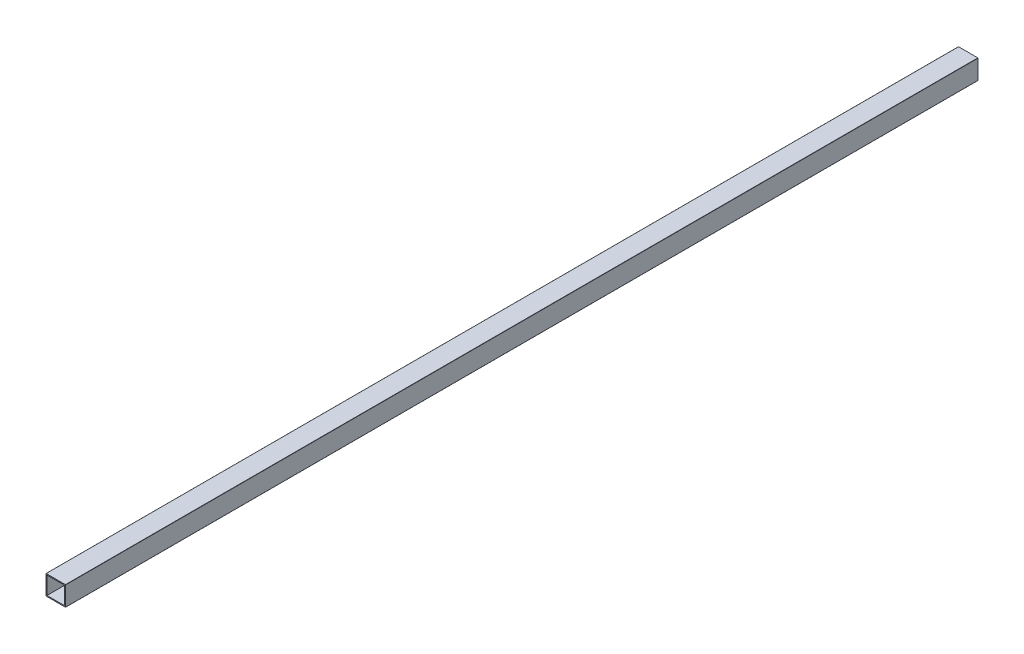
ISO-10303-21;
HEADER;
FILE_DESCRIPTION(('STEP AP214'),'2;1');
FILE_NAME('part.step','',(''),(''),'','','');
FILE_SCHEMA(('AUTOMOTIVE_DESIGN { 1 0 10303 214 1 1 1 1 }'));
ENDSEC;
DATA;
#1=APPLICATION_CONTEXT('core data for automotive mechanical design processes');
#2=APPLICATION_PROTOCOL_DEFINITION('international standard','automotive_design',2000,#1);
#3=PRODUCT_CONTEXT('',#1,'mechanical');
#4=PRODUCT('Part','Part','',(#3));
#5=PRODUCT_RELATED_PRODUCT_CATEGORY('part','',(#4));
#6=PRODUCT_DEFINITION_FORMATION('','',#4);
#7=PRODUCT_DEFINITION_CONTEXT('part definition',#1,'design');
#8=PRODUCT_DEFINITION('design','',#6,#7);
#9=PRODUCT_DEFINITION_SHAPE('','',#8);
#10=(LENGTH_UNIT() NAMED_UNIT(*) SI_UNIT(.MILLI.,.METRE.));
#11=(NAMED_UNIT(*) PLANE_ANGLE_UNIT() SI_UNIT($,.RADIAN.));
#12=(NAMED_UNIT(*) SI_UNIT($,.STERADIAN.) SOLID_ANGLE_UNIT());
#13=UNCERTAINTY_MEASURE_WITH_UNIT(LENGTH_MEASURE(1.E-05),#10,'distance_accuracy_value','');
#14=(GEOMETRIC_REPRESENTATION_CONTEXT(3) GLOBAL_UNCERTAINTY_ASSIGNED_CONTEXT((#13)) GLOBAL_UNIT_ASSIGNED_CONTEXT((#10,
#11,#12)) REPRESENTATION_CONTEXT('',''));
#15=CARTESIAN_POINT('',(0.,0.,0.));
#16=DIRECTION('',(0.,0.,1.));
#17=DIRECTION('',(1.,0.,0.));
#18=AXIS2_PLACEMENT_3D('',#15,#16,#17);
#19=CARTESIAN_POINT('',(0.2,0.2,930.));
#20=DIRECTION('',(0.,0.,-1.));
#21=DIRECTION('',(-1.,0.,0.));
#22=AXIS2_PLACEMENT_3D('',#19,#20,#21);
#23=PLANE('',#22);
#24=CARTESIAN_POINT('',(0.2,0.2,930.));
#25=DIRECTION('',(0.,0.,1.));
#26=DIRECTION('',(-1.,0.,0.));
#27=AXIS2_PLACEMENT_3D('',#24,#25,#26);
#28=CIRCLE('',#27,0.2);
#29=CARTESIAN_POINT('',(0.,0.200000000000001,930.));
#30=VERTEX_POINT('',#29);
#31=CARTESIAN_POINT('',(0.200000000000001,0.,930.));
#32=VERTEX_POINT('',#31);
#33=EDGE_CURVE('E159',#30,#32,#28,.T.);
#34=ORIENTED_EDGE('',*,*,#33,.T.);
#35=DIRECTION('',(1.,0.,0.));
#36=VECTOR('',#35,1.);
#37=CARTESIAN_POINT('',(0.200000000000001,0.,930.));
#38=LINE('',#37,#36);
#39=CARTESIAN_POINT('',(19.8,0.,930.));
#40=VERTEX_POINT('',#39);
#41=EDGE_CURVE('E162',#32,#40,#38,.T.);
#42=ORIENTED_EDGE('',*,*,#41,.T.);
#43=CARTESIAN_POINT('',(19.8,0.2,930.));
#44=DIRECTION('',(0.,0.,1.));
#45=DIRECTION('',(1.,0.,0.));
#46=AXIS2_PLACEMENT_3D('',#43,#44,#45);
#47=CIRCLE('',#46,0.199999999999999);
#48=CARTESIAN_POINT('',(20.,0.2,930.));
#49=VERTEX_POINT('',#48);
#50=EDGE_CURVE('E165',#40,#49,#47,.T.);
#51=ORIENTED_EDGE('',*,*,#50,.T.);
#52=DIRECTION('',(0.,1.,0.));
#53=VECTOR('',#52,1.);
#54=CARTESIAN_POINT('',(20.,0.2,930.));
#55=LINE('',#54,#53);
#56=CARTESIAN_POINT('',(20.,19.8,930.));
#57=VERTEX_POINT('',#56);
#58=EDGE_CURVE('E167',#49,#57,#55,.T.);
#59=ORIENTED_EDGE('',*,*,#58,.T.);
#60=CARTESIAN_POINT('',(19.8,19.8,930.));
#61=DIRECTION('',(0.,0.,1.));
#62=DIRECTION('',(-1.,0.,0.));
#63=AXIS2_PLACEMENT_3D('',#60,#61,#62);
#64=CIRCLE('',#63,0.199999999999997);
#65=CARTESIAN_POINT('',(19.8,20.,930.));
#66=VERTEX_POINT('',#65);
#67=EDGE_CURVE('E169',#57,#66,#64,.T.);
#68=ORIENTED_EDGE('',*,*,#67,.T.);
#69=DIRECTION('',(-1.,0.,0.));
#70=VECTOR('',#69,1.);
#71=CARTESIAN_POINT('',(0.2,20.,930.));
#72=LINE('',#71,#70);
#73=CARTESIAN_POINT('',(0.2,20.,930.));
#74=VERTEX_POINT('',#73);
#75=EDGE_CURVE('E171',#66,#74,#72,.T.);
#76=ORIENTED_EDGE('',*,*,#75,.T.);
#77=CARTESIAN_POINT('',(0.2,19.8,930.));
#78=DIRECTION('',(0.,0.,1.));
#79=DIRECTION('',(-1.,0.,0.));
#80=AXIS2_PLACEMENT_3D('',#77,#78,#79);
#81=CIRCLE('',#80,0.199999999999998);
#82=CARTESIAN_POINT('',(0.,19.8,930.));
#83=VERTEX_POINT('',#82);
#84=EDGE_CURVE('E173',#74,#83,#81,.T.);
#85=ORIENTED_EDGE('',*,*,#84,.T.);
#86=DIRECTION('',(0.,-1.,0.));
#87=VECTOR('',#86,1.);
#88=CARTESIAN_POINT('',(0.,0.200000000000001,930.));
#89=LINE('',#88,#87);
#90=EDGE_CURVE('E175',#83,#30,#89,.T.);
#91=ORIENTED_EDGE('',*,*,#90,.T.);
#92=EDGE_LOOP('',(#34,#42,#51,#59,#68,#76,#85,#91));
#93=FACE_BOUND('',#92,.T.);
#94=DIRECTION('',(0.,-1.,0.));
#95=VECTOR('',#94,1.);
#96=CARTESIAN_POINT('',(1.,1.,930.));
#97=LINE('',#96,#95);
#98=CARTESIAN_POINT('',(1.,19.,930.));
#99=VERTEX_POINT('',#98);
#100=CARTESIAN_POINT('',(1.,1.,930.));
#101=VERTEX_POINT('',#100);
#102=EDGE_CURVE('E123',#99,#101,#97,.T.);
#103=ORIENTED_EDGE('',*,*,#102,.F.);
#104=DIRECTION('',(-1.,0.,0.));
#105=VECTOR('',#104,1.);
#106=CARTESIAN_POINT('',(1.,19.,930.));
#107=LINE('',#106,#105);
#108=CARTESIAN_POINT('',(19.,19.,930.));
#109=VERTEX_POINT('',#108);
#110=EDGE_CURVE('E145',#109,#99,#107,.T.);
#111=ORIENTED_EDGE('',*,*,#110,.F.);
#112=DIRECTION('',(0.,1.,0.));
#113=VECTOR('',#112,1.);
#114=CARTESIAN_POINT('',(19.,1.,930.));
#115=LINE('',#114,#113);
#116=CARTESIAN_POINT('',(19.,1.,930.));
#117=VERTEX_POINT('',#116);
#118=EDGE_CURVE('E143',#117,#109,#115,.T.);
#119=ORIENTED_EDGE('',*,*,#118,.F.);
#120=DIRECTION('',(1.,0.,0.));
#121=VECTOR('',#120,1.);
#122=CARTESIAN_POINT('',(1.,1.,930.));
#123=LINE('',#122,#121);
#124=EDGE_CURVE('E131',#101,#117,#123,.T.);
#125=ORIENTED_EDGE('',*,*,#124,.F.);
#126=EDGE_LOOP('',(#103,#111,#119,#125));
#127=FACE_BOUND('',#126,.T.);
#128=ADVANCED_FACE('F34',(#93,#127),#23,.F.);
#129=CARTESIAN_POINT('',(0.2,0.2,0.));
#130=DIRECTION('',(0.,0.,-1.));
#131=DIRECTION('',(-1.,0.,0.));
#132=AXIS2_PLACEMENT_3D('',#129,#130,#131);
#133=PLANE('',#132);
#134=CARTESIAN_POINT('',(0.2,0.2,0.));
#135=DIRECTION('',(0.,0.,1.));
#136=DIRECTION('',(-1.,0.,0.));
#137=AXIS2_PLACEMENT_3D('',#134,#135,#136);
#138=CIRCLE('',#137,0.2);
#139=CARTESIAN_POINT('',(0.,0.200000000000001,0.));
#140=VERTEX_POINT('',#139);
#141=CARTESIAN_POINT('',(0.200000000000001,0.,0.));
#142=VERTEX_POINT('',#141);
#143=EDGE_CURVE('E139',#140,#142,#138,.T.);
#144=ORIENTED_EDGE('',*,*,#143,.F.);
#145=DIRECTION('',(0.,-1.,0.));
#146=VECTOR('',#145,1.);
#147=CARTESIAN_POINT('',(0.,0.200000000000001,0.));
#148=LINE('',#147,#146);
#149=CARTESIAN_POINT('',(0.,19.8,0.));
#150=VERTEX_POINT('',#149);
#151=EDGE_CURVE('E163',#150,#140,#148,.T.);
#152=ORIENTED_EDGE('',*,*,#151,.F.);
#153=CARTESIAN_POINT('',(0.2,19.8,0.));
#154=DIRECTION('',(0.,0.,1.));
#155=DIRECTION('',(-1.,0.,0.));
#156=AXIS2_PLACEMENT_3D('',#153,#154,#155);
#157=CIRCLE('',#156,0.199999999999998);
#158=CARTESIAN_POINT('',(0.2,20.,0.));
#159=VERTEX_POINT('',#158);
#160=EDGE_CURVE('E190',#159,#150,#157,.T.);
#161=ORIENTED_EDGE('',*,*,#160,.F.);
#162=DIRECTION('',(-1.,0.,0.));
#163=VECTOR('',#162,1.);
#164=CARTESIAN_POINT('',(0.2,20.,0.));
#165=LINE('',#164,#163);
#166=CARTESIAN_POINT('',(19.8,20.,0.));
#167=VERTEX_POINT('',#166);
#168=EDGE_CURVE('E188',#167,#159,#165,.T.);
#169=ORIENTED_EDGE('',*,*,#168,.F.);
#170=CARTESIAN_POINT('',(19.8,19.8,0.));
#171=DIRECTION('',(0.,0.,1.));
#172=DIRECTION('',(-1.,0.,0.));
#173=AXIS2_PLACEMENT_3D('',#170,#171,#172);
#174=CIRCLE('',#173,0.199999999999997);
#175=CARTESIAN_POINT('',(20.,19.8,0.));
#176=VERTEX_POINT('',#175);
#177=EDGE_CURVE('E186',#176,#167,#174,.T.);
#178=ORIENTED_EDGE('',*,*,#177,.F.);
#179=DIRECTION('',(0.,1.,0.));
#180=VECTOR('',#179,1.);
#181=CARTESIAN_POINT('',(20.,0.2,0.));
#182=LINE('',#181,#180);
#183=CARTESIAN_POINT('',(20.,0.2,0.));
#184=VERTEX_POINT('',#183);
#185=EDGE_CURVE('E184',#184,#176,#182,.T.);
#186=ORIENTED_EDGE('',*,*,#185,.F.);
#187=CARTESIAN_POINT('',(19.8,0.2,0.));
#188=DIRECTION('',(0.,0.,1.));
#189=DIRECTION('',(1.,0.,0.));
#190=AXIS2_PLACEMENT_3D('',#187,#188,#189);
#191=CIRCLE('',#190,0.199999999999999);
#192=CARTESIAN_POINT('',(19.8,0.,0.));
#193=VERTEX_POINT('',#192);
#194=EDGE_CURVE('E182',#193,#184,#191,.T.);
#195=ORIENTED_EDGE('',*,*,#194,.F.);
#196=DIRECTION('',(1.,0.,0.));
#197=VECTOR('',#196,1.);
#198=CARTESIAN_POINT('',(0.200000000000001,0.,0.));
#199=LINE('',#198,#197);
#200=EDGE_CURVE('E180',#142,#193,#199,.T.);
#201=ORIENTED_EDGE('',*,*,#200,.F.);
#202=EDGE_LOOP('',(#144,#152,#161,#169,#178,#186,#195,#201));
#203=FACE_BOUND('',#202,.T.);
#204=DIRECTION('',(-1.,0.,0.));
#205=VECTOR('',#204,1.);
#206=CARTESIAN_POINT('',(1.,19.,0.));
#207=LINE('',#206,#205);
#208=CARTESIAN_POINT('',(19.,19.,0.));
#209=VERTEX_POINT('',#208);
#210=CARTESIAN_POINT('',(1.,19.,0.));
#211=VERTEX_POINT('',#210);
#212=EDGE_CURVE('E132',#209,#211,#207,.T.);
#213=ORIENTED_EDGE('',*,*,#212,.T.);
#214=DIRECTION('',(0.,-1.,0.));
#215=VECTOR('',#214,1.);
#216=CARTESIAN_POINT('',(1.,1.,0.));
#217=LINE('',#216,#215);
#218=CARTESIAN_POINT('',(1.,1.,0.));
#219=VERTEX_POINT('',#218);
#220=EDGE_CURVE('E57',#211,#219,#217,.T.);
#221=ORIENTED_EDGE('',*,*,#220,.T.);
#222=DIRECTION('',(1.,0.,0.));
#223=VECTOR('',#222,1.);
#224=CARTESIAN_POINT('',(1.,1.,0.));
#225=LINE('',#224,#223);
#226=CARTESIAN_POINT('',(19.,1.,0.));
#227=VERTEX_POINT('',#226);
#228=EDGE_CURVE('E138',#219,#227,#225,.T.);
#229=ORIENTED_EDGE('',*,*,#228,.T.);
#230=DIRECTION('',(0.,1.,0.));
#231=VECTOR('',#230,1.);
#232=CARTESIAN_POINT('',(19.,1.,0.));
#233=LINE('',#232,#231);
#234=EDGE_CURVE('E151',#227,#209,#233,.T.);
#235=ORIENTED_EDGE('',*,*,#234,.T.);
#236=EDGE_LOOP('',(#213,#221,#229,#235));
#237=FACE_BOUND('',#236,.T.);
#238=ADVANCED_FACE('F220',(#203,#237),#133,.T.);
#239=CARTESIAN_POINT('',(0.2,0.2,930.));
#240=DIRECTION('',(0.,0.,-1.));
#241=DIRECTION('',(-1.,0.,0.));
#242=AXIS2_PLACEMENT_3D('',#239,#240,#241);
#243=CYLINDRICAL_SURFACE('',#242,0.2);
#244=ORIENTED_EDGE('',*,*,#143,.T.);
#245=DIRECTION('',(0.,0.,-1.));
#246=VECTOR('',#245,1.);
#247=CARTESIAN_POINT('',(0.200000000000001,0.,930.));
#248=LINE('',#247,#246);
#249=EDGE_CURVE('E11',#32,#142,#248,.T.);
#250=ORIENTED_EDGE('',*,*,#249,.F.);
#251=ORIENTED_EDGE('',*,*,#33,.F.);
#252=DIRECTION('',(0.,0.,-1.));
#253=VECTOR('',#252,1.);
#254=CARTESIAN_POINT('',(0.,0.200000000000001,930.));
#255=LINE('',#254,#253);
#256=EDGE_CURVE('E177',#30,#140,#255,.T.);
#257=ORIENTED_EDGE('',*,*,#256,.T.);
#258=EDGE_LOOP('',(#244,#250,#251,#257));
#259=FACE_BOUND('',#258,.T.);
#260=ADVANCED_FACE('F36',(#259),#243,.T.);
#261=CARTESIAN_POINT('',(0.200000000000001,0.,930.));
#262=DIRECTION('',(0.,1.,0.));
#263=DIRECTION('',(0.,0.,1.));
#264=AXIS2_PLACEMENT_3D('',#261,#262,#263);
#265=PLANE('',#264);
#266=ORIENTED_EDGE('',*,*,#200,.T.);
#267=DIRECTION('',(0.,0.,-1.));
#268=VECTOR('',#267,1.);
#269=CARTESIAN_POINT('',(19.8,0.,930.));
#270=LINE('',#269,#268);
#271=EDGE_CURVE('E42',#40,#193,#270,.T.);
#272=ORIENTED_EDGE('',*,*,#271,.F.);
#273=ORIENTED_EDGE('',*,*,#41,.F.);
#274=ORIENTED_EDGE('',*,*,#249,.T.);
#275=EDGE_LOOP('',(#266,#272,#273,#274));
#276=FACE_BOUND('',#275,.T.);
#277=ADVANCED_FACE('F237',(#276),#265,.F.);
#278=CARTESIAN_POINT('',(19.8,0.2,930.));
#279=DIRECTION('',(0.,0.,-1.));
#280=DIRECTION('',(-1.,0.,0.));
#281=AXIS2_PLACEMENT_3D('',#278,#279,#280);
#282=CYLINDRICAL_SURFACE('',#281,0.199999999999999);
#283=ORIENTED_EDGE('',*,*,#194,.T.);
#284=DIRECTION('',(0.,0.,-1.));
#285=VECTOR('',#284,1.);
#286=CARTESIAN_POINT('',(20.,0.2,930.));
#287=LINE('',#286,#285);
#288=EDGE_CURVE('E207',#49,#184,#287,.T.);
#289=ORIENTED_EDGE('',*,*,#288,.F.);
#290=ORIENTED_EDGE('',*,*,#50,.F.);
#291=ORIENTED_EDGE('',*,*,#271,.T.);
#292=EDGE_LOOP('',(#283,#289,#290,#291));
#293=FACE_BOUND('',#292,.T.);
#294=ADVANCED_FACE('F214',(#293),#282,.T.);
#295=CARTESIAN_POINT('',(20.,0.2,930.));
#296=DIRECTION('',(-1.,0.,0.));
#297=DIRECTION('',(0.,-1.,0.));
#298=AXIS2_PLACEMENT_3D('',#295,#296,#297);
#299=PLANE('',#298);
#300=ORIENTED_EDGE('',*,*,#185,.T.);
#301=DIRECTION('',(0.,0.,-1.));
#302=VECTOR('',#301,1.);
#303=CARTESIAN_POINT('',(20.,19.8,930.));
#304=LINE('',#303,#302);
#305=EDGE_CURVE('E204',#57,#176,#304,.T.);
#306=ORIENTED_EDGE('',*,*,#305,.F.);
#307=ORIENTED_EDGE('',*,*,#58,.F.);
#308=ORIENTED_EDGE('',*,*,#288,.T.);
#309=EDGE_LOOP('',(#300,#306,#307,#308));
#310=FACE_BOUND('',#309,.T.);
#311=ADVANCED_FACE('F226',(#310),#299,.F.);
#312=CARTESIAN_POINT('',(19.8,19.8,930.));
#313=DIRECTION('',(0.,0.,-1.));
#314=DIRECTION('',(-1.,0.,0.));
#315=AXIS2_PLACEMENT_3D('',#312,#313,#314);
#316=CYLINDRICAL_SURFACE('',#315,0.199999999999997);
#317=ORIENTED_EDGE('',*,*,#177,.T.);
#318=DIRECTION('',(0.,0.,-1.));
#319=VECTOR('',#318,1.);
#320=CARTESIAN_POINT('',(19.8,20.,930.));
#321=LINE('',#320,#319);
#322=EDGE_CURVE('E201',#66,#167,#321,.T.);
#323=ORIENTED_EDGE('',*,*,#322,.F.);
#324=ORIENTED_EDGE('',*,*,#67,.F.);
#325=ORIENTED_EDGE('',*,*,#305,.T.);
#326=EDGE_LOOP('',(#317,#323,#324,#325));
#327=FACE_BOUND('',#326,.T.);
#328=ADVANCED_FACE('F230',(#327),#316,.T.);
#329=CARTESIAN_POINT('',(0.2,20.,930.));
#330=DIRECTION('',(0.,-1.,0.));
#331=DIRECTION('',(0.,0.,-1.));
#332=AXIS2_PLACEMENT_3D('',#329,#330,#331);
#333=PLANE('',#332);
#334=ORIENTED_EDGE('',*,*,#168,.T.);
#335=DIRECTION('',(0.,0.,-1.));
#336=VECTOR('',#335,1.);
#337=CARTESIAN_POINT('',(0.2,20.,930.));
#338=LINE('',#337,#336);
#339=EDGE_CURVE('E198',#74,#159,#338,.T.);
#340=ORIENTED_EDGE('',*,*,#339,.F.);
#341=ORIENTED_EDGE('',*,*,#75,.F.);
#342=ORIENTED_EDGE('',*,*,#322,.T.);
#343=EDGE_LOOP('',(#334,#340,#341,#342));
#344=FACE_BOUND('',#343,.T.);
#345=ADVANCED_FACE('F250',(#344),#333,.F.);
#346=CARTESIAN_POINT('',(0.2,19.8,930.));
#347=DIRECTION('',(0.,0.,-1.));
#348=DIRECTION('',(-1.,0.,0.));
#349=AXIS2_PLACEMENT_3D('',#346,#347,#348);
#350=CYLINDRICAL_SURFACE('',#349,0.199999999999998);
#351=ORIENTED_EDGE('',*,*,#160,.T.);
#352=DIRECTION('',(0.,0.,-1.));
#353=VECTOR('',#352,1.);
#354=CARTESIAN_POINT('',(0.,19.8,930.));
#355=LINE('',#354,#353);
#356=EDGE_CURVE('E195',#83,#150,#355,.T.);
#357=ORIENTED_EDGE('',*,*,#356,.F.);
#358=ORIENTED_EDGE('',*,*,#84,.F.);
#359=ORIENTED_EDGE('',*,*,#339,.T.);
#360=EDGE_LOOP('',(#351,#357,#358,#359));
#361=FACE_BOUND('',#360,.T.);
#362=ADVANCED_FACE('F248',(#361),#350,.T.);
#363=CARTESIAN_POINT('',(0.,0.200000000000001,930.));
#364=DIRECTION('',(1.,0.,0.));
#365=DIRECTION('',(0.,1.,0.));
#366=AXIS2_PLACEMENT_3D('',#363,#364,#365);
#367=PLANE('',#366);
#368=ORIENTED_EDGE('',*,*,#151,.T.);
#369=ORIENTED_EDGE('',*,*,#256,.F.);
#370=ORIENTED_EDGE('',*,*,#90,.F.);
#371=ORIENTED_EDGE('',*,*,#356,.T.);
#372=EDGE_LOOP('',(#368,#369,#370,#371));
#373=FACE_BOUND('',#372,.T.);
#374=ADVANCED_FACE('F243',(#373),#367,.F.);
#375=CARTESIAN_POINT('',(1.,1.,930.));
#376=DIRECTION('',(1.,0.,0.));
#377=DIRECTION('',(0.,0.,-1.));
#378=AXIS2_PLACEMENT_3D('',#375,#376,#377);
#379=PLANE('',#378);
#380=ORIENTED_EDGE('',*,*,#220,.F.);
#381=DIRECTION('',(0.,0.,-1.));
#382=VECTOR('',#381,1.);
#383=CARTESIAN_POINT('',(1.,19.,930.));
#384=LINE('',#383,#382);
#385=EDGE_CURVE('E127',#99,#211,#384,.T.);
#386=ORIENTED_EDGE('',*,*,#385,.F.);
#387=ORIENTED_EDGE('',*,*,#102,.T.);
#388=DIRECTION('',(0.,0.,-1.));
#389=VECTOR('',#388,1.);
#390=CARTESIAN_POINT('',(1.,1.,930.));
#391=LINE('',#390,#389);
#392=EDGE_CURVE('E126',#101,#219,#391,.T.);
#393=ORIENTED_EDGE('',*,*,#392,.T.);
#394=EDGE_LOOP('',(#380,#386,#387,#393));
#395=FACE_BOUND('',#394,.T.);
#396=ADVANCED_FACE('F125',(#395),#379,.T.);
#397=CARTESIAN_POINT('',(1.,1.,930.));
#398=DIRECTION('',(0.,1.,0.));
#399=DIRECTION('',(0.,0.,1.));
#400=AXIS2_PLACEMENT_3D('',#397,#398,#399);
#401=PLANE('',#400);
#402=ORIENTED_EDGE('',*,*,#228,.F.);
#403=ORIENTED_EDGE('',*,*,#392,.F.);
#404=ORIENTED_EDGE('',*,*,#124,.T.);
#405=DIRECTION('',(0.,0.,-1.));
#406=VECTOR('',#405,1.);
#407=CARTESIAN_POINT('',(19.,1.,930.));
#408=LINE('',#407,#406);
#409=EDGE_CURVE('E140',#117,#227,#408,.T.);
#410=ORIENTED_EDGE('',*,*,#409,.T.);
#411=EDGE_LOOP('',(#402,#403,#404,#410));
#412=FACE_BOUND('',#411,.T.);
#413=ADVANCED_FACE('F135',(#412),#401,.T.);
#414=CARTESIAN_POINT('',(19.,1.,930.));
#415=DIRECTION('',(-1.,0.,0.));
#416=DIRECTION('',(0.,-1.,0.));
#417=AXIS2_PLACEMENT_3D('',#414,#415,#416);
#418=PLANE('',#417);
#419=ORIENTED_EDGE('',*,*,#234,.F.);
#420=ORIENTED_EDGE('',*,*,#409,.F.);
#421=ORIENTED_EDGE('',*,*,#118,.T.);
#422=DIRECTION('',(0.,0.,-1.));
#423=VECTOR('',#422,1.);
#424=CARTESIAN_POINT('',(19.,19.,930.));
#425=LINE('',#424,#423);
#426=EDGE_CURVE('E49',#109,#209,#425,.T.);
#427=ORIENTED_EDGE('',*,*,#426,.T.);
#428=EDGE_LOOP('',(#419,#420,#421,#427));
#429=FACE_BOUND('',#428,.T.);
#430=ADVANCED_FACE('F275',(#429),#418,.T.);
#431=CARTESIAN_POINT('',(1.,19.,930.));
#432=DIRECTION('',(0.,-1.,0.));
#433=DIRECTION('',(0.,0.,-1.));
#434=AXIS2_PLACEMENT_3D('',#431,#432,#433);
#435=PLANE('',#434);
#436=ORIENTED_EDGE('',*,*,#212,.F.);
#437=ORIENTED_EDGE('',*,*,#426,.F.);
#438=ORIENTED_EDGE('',*,*,#110,.T.);
#439=ORIENTED_EDGE('',*,*,#385,.T.);
#440=EDGE_LOOP('',(#436,#437,#438,#439));
#441=FACE_BOUND('',#440,.T.);
#442=ADVANCED_FACE('F279',(#441),#435,.T.);
#443=CLOSED_SHELL('',(#128,#238,#260,#277,#294,#311,#328,#345,#362,#374,#396,#413,#430,#442));
#444=MANIFOLD_SOLID_BREP('B2',#443);
#445=ADVANCED_BREP_SHAPE_REPRESENTATION('',(#18,#444),#14);
#446=SHAPE_DEFINITION_REPRESENTATION(#9,#445);
ENDSEC;
END-ISO-10303-21;
